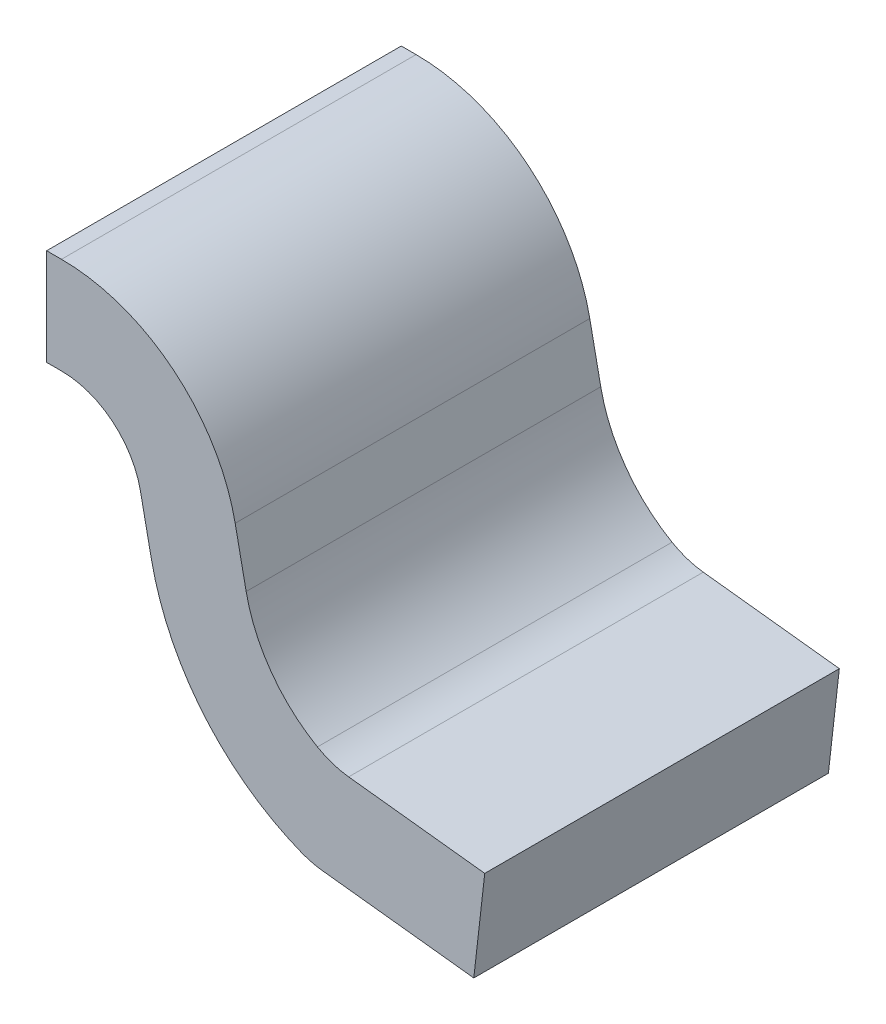
ISO-10303-21;
HEADER;
FILE_DESCRIPTION(('STEP AP214'),'2;1');
FILE_NAME('part.step','',(''),(''),'','','');
FILE_SCHEMA(('AUTOMOTIVE_DESIGN { 1 0 10303 214 1 1 1 1 }'));
ENDSEC;
DATA;
#1=APPLICATION_CONTEXT('core data for automotive mechanical design processes');
#2=APPLICATION_PROTOCOL_DEFINITION('international standard','automotive_design',2000,#1);
#3=PRODUCT_CONTEXT('',#1,'mechanical');
#4=PRODUCT('Part','Part','',(#3));
#5=PRODUCT_RELATED_PRODUCT_CATEGORY('part','',(#4));
#6=PRODUCT_DEFINITION_FORMATION('','',#4);
#7=PRODUCT_DEFINITION_CONTEXT('part definition',#1,'design');
#8=PRODUCT_DEFINITION('design','',#6,#7);
#9=PRODUCT_DEFINITION_SHAPE('','',#8);
#10=(LENGTH_UNIT() NAMED_UNIT(*) SI_UNIT(.MILLI.,.METRE.));
#11=(NAMED_UNIT(*) PLANE_ANGLE_UNIT() SI_UNIT($,.RADIAN.));
#12=(NAMED_UNIT(*) SI_UNIT($,.STERADIAN.) SOLID_ANGLE_UNIT());
#13=UNCERTAINTY_MEASURE_WITH_UNIT(LENGTH_MEASURE(1.E-05),#10,'distance_accuracy_value','');
#14=(GEOMETRIC_REPRESENTATION_CONTEXT(3) GLOBAL_UNCERTAINTY_ASSIGNED_CONTEXT((#13)) GLOBAL_UNIT_ASSIGNED_CONTEXT((#10,
#11,#12)) REPRESENTATION_CONTEXT('',''));
#15=CARTESIAN_POINT('',(0.,0.,0.));
#16=DIRECTION('',(0.,0.,1.));
#17=DIRECTION('',(1.,0.,0.));
#18=AXIS2_PLACEMENT_3D('',#15,#16,#17);
#19=CARTESIAN_POINT('',(1.0784798395513,0.311122151443952,3.64984430510635));
#20=DIRECTION('',(0.,0.,-1.));
#21=DIRECTION('',(-1.,0.,0.));
#22=AXIS2_PLACEMENT_3D('',#19,#20,#21);
#23=CYLINDRICAL_SURFACE('',#22,0.304673812487565);
#24=DIRECTION('',(0.,0.,1.));
#25=VECTOR('',#24,1.);
#26=CARTESIAN_POINT('',(0.966363747755728,0.0278270509282633,3.64984430510635));
#27=LINE('',#26,#25);
#28=CARTESIAN_POINT('',(0.966363747755728,0.0278270509282633,0.28));
#29=VERTEX_POINT('',#28);
#30=CARTESIAN_POINT('',(0.966363747755728,0.0278270509282633,0.72));
#31=VERTEX_POINT('',#30);
#32=EDGE_CURVE('E11',#29,#31,#27,.T.);
#33=ORIENTED_EDGE('',*,*,#32,.T.);
#34=CARTESIAN_POINT('',(1.0784798395513,0.311122151443952,0.72));
#35=DIRECTION('',(0.,0.,-1.));
#36=DIRECTION('',(-1.,0.,0.));
#37=AXIS2_PLACEMENT_3D('',#34,#35,#36);
#38=CIRCLE('',#37,0.304673812487565);
#39=CARTESIAN_POINT('',(0.78,0.25,0.72));
#40=VERTEX_POINT('',#39);
#41=EDGE_CURVE('E26',#31,#40,#38,.T.);
#42=ORIENTED_EDGE('',*,*,#41,.T.);
#43=DIRECTION('',(0.,0.,-1.));
#44=VECTOR('',#43,1.);
#45=CARTESIAN_POINT('',(0.78,0.25,3.64984430510635));
#46=LINE('',#45,#44);
#47=CARTESIAN_POINT('',(0.78,0.25,0.28));
#48=VERTEX_POINT('',#47);
#49=EDGE_CURVE('E252',#40,#48,#46,.T.);
#50=ORIENTED_EDGE('',*,*,#49,.T.);
#51=CARTESIAN_POINT('',(1.0784798395513,0.311122151443952,0.28));
#52=DIRECTION('',(0.,0.,1.));
#53=DIRECTION('',(-1.,0.,0.));
#54=AXIS2_PLACEMENT_3D('',#51,#52,#53);
#55=CIRCLE('',#54,0.304673812487565);
#56=EDGE_CURVE('E150',#48,#29,#55,.T.);
#57=ORIENTED_EDGE('',*,*,#56,.T.);
#58=EDGE_LOOP('',(#33,#42,#50,#57));
#59=FACE_BOUND('',#58,.T.);
#60=ADVANCED_FACE('F16',(#59),#23,.T.);
#61=CARTESIAN_POINT('',(-2.74150408033977,0.,0.72));
#62=DIRECTION('',(0.,0.,-1.));
#63=DIRECTION('',(0.707106781186548,0.707106781186548,0.));
#64=AXIS2_PLACEMENT_3D('',#61,#62,#63);
#65=PLANE('',#64);
#66=DIRECTION('',(-0.200615047761769,0.979670149903294,0.));
#67=VECTOR('',#66,1.);
#68=CARTESIAN_POINT('',(0.78,0.25,0.72));
#69=LINE('',#68,#67);
#70=CARTESIAN_POINT('',(0.766369657725015,0.316561504776177,0.72));
#71=VERTEX_POINT('',#70);
#72=EDGE_CURVE('E190',#40,#71,#69,.T.);
#73=ORIENTED_EDGE('',*,*,#72,.F.);
#74=ORIENTED_EDGE('',*,*,#41,.F.);
#75=CARTESIAN_POINT('',(1.003162477151,0.120810132802834,0.72));
#76=DIRECTION('',(0.,0.,-1.));
#77=DIRECTION('',(-1.,0.,0.));
#78=AXIS2_PLACEMENT_3D('',#75,#76,#77);
#79=CIRCLE('',#78,0.1);
#80=CARTESIAN_POINT('',(0.991834300901522,0.0214538424993983,0.72));
#81=VERTEX_POINT('',#80);
#82=EDGE_CURVE('E151',#81,#31,#79,.T.);
#83=ORIENTED_EDGE('',*,*,#82,.F.);
#84=DIRECTION('',(-0.993562903034357,0.113281762494854,0.));
#85=VECTOR('',#84,1.);
#86=CARTESIAN_POINT('',(1.17999999999987,0.,0.72));
#87=LINE('',#86,#85);
#88=CARTESIAN_POINT('',(1.17999999999987,0.,0.72));
#89=VERTEX_POINT('',#88);
#90=EDGE_CURVE('E184',#89,#81,#87,.T.);
#91=ORIENTED_EDGE('',*,*,#90,.F.);
#92=DIRECTION('',(-0.113281762495859,-0.993562903034243,0.));
#93=VECTOR('',#92,1.);
#94=CARTESIAN_POINT('',(1.19359381149938,0.119227548364123,0.72));
#95=LINE('',#94,#93);
#96=CARTESIAN_POINT('',(1.19359381149938,0.119227548364123,0.72));
#97=VERTEX_POINT('',#96);
#98=EDGE_CURVE('E185',#97,#89,#95,.T.);
#99=ORIENTED_EDGE('',*,*,#98,.F.);
#100=DIRECTION('',(0.993562903034362,-0.113281762494814,0.));
#101=VECTOR('',#100,1.);
#102=CARTESIAN_POINT('',(1.02473971532561,0.138479565081551,0.72));
#103=LINE('',#102,#101);
#104=CARTESIAN_POINT('',(1.02473971532561,0.138479565081551,0.72));
#105=VERTEX_POINT('',#104);
#106=EDGE_CURVE('E180',#105,#97,#103,.T.);
#107=ORIENTED_EDGE('',*,*,#106,.F.);
#108=CARTESIAN_POINT('',(1.03606789157509,0.237835855384987,0.72));
#109=DIRECTION('',(0.,0.,1.));
#110=DIRECTION('',(-1.,0.,0.));
#111=AXIS2_PLACEMENT_3D('',#108,#109,#110);
#112=CIRCLE('',#111,0.1);
#113=CARTESIAN_POINT('',(0.985979267087511,0.151284542876497,0.72));
#114=VERTEX_POINT('',#113);
#115=EDGE_CURVE('E175',#114,#105,#112,.T.);
#116=ORIENTED_EDGE('',*,*,#115,.F.);
#117=CARTESIAN_POINT('',(1.0784798395513,0.311122151443952,0.72));
#118=DIRECTION('',(0.,0.,1.));
#119=DIRECTION('',(-1.,0.,0.));
#120=AXIS2_PLACEMENT_3D('',#117,#118,#119);
#121=CIRCLE('',#120,0.184673812487565);
#122=CARTESIAN_POINT('',(0.897560417988396,0.274073805731411,0.72));
#123=VERTEX_POINT('',#122);
#124=EDGE_CURVE('E170',#123,#114,#121,.T.);
#125=ORIENTED_EDGE('',*,*,#124,.F.);
#126=DIRECTION('',(0.20061504776177,-0.979670149903294,0.));
#127=VECTOR('',#126,1.);
#128=CARTESIAN_POINT('',(0.883930075713411,0.340635310507587,0.72));
#129=LINE('',#128,#127);
#130=CARTESIAN_POINT('',(0.883930075713411,0.340635310507588,0.72));
#131=VERTEX_POINT('',#130);
#132=EDGE_CURVE('E165',#131,#123,#129,.T.);
#133=ORIENTED_EDGE('',*,*,#132,.F.);
#134=CARTESIAN_POINT('',(0.668402642734686,0.2965,0.72));
#135=DIRECTION('',(0.,0.,-1.));
#136=DIRECTION('',(-1.,0.,0.));
#137=AXIS2_PLACEMENT_3D('',#134,#135,#136);
#138=CIRCLE('',#137,0.22);
#139=CARTESIAN_POINT('',(0.668402642734686,0.5165,0.72));
#140=VERTEX_POINT('',#139);
#141=EDGE_CURVE('E208',#140,#131,#138,.T.);
#142=ORIENTED_EDGE('',*,*,#141,.F.);
#143=DIRECTION('',(1.,0.,0.));
#144=VECTOR('',#143,1.);
#145=CARTESIAN_POINT('',(-2.74150408033977,0.5165,0.72));
#146=LINE('',#145,#144);
#147=CARTESIAN_POINT('',(0.65,0.5165,0.72));
#148=VERTEX_POINT('',#147);
#149=EDGE_CURVE('E132',#148,#140,#146,.T.);
#150=ORIENTED_EDGE('',*,*,#149,.F.);
#151=DIRECTION('',(0.,1.,0.));
#152=VECTOR('',#151,1.);
#153=CARTESIAN_POINT('',(0.65,0.,0.72));
#154=LINE('',#153,#152);
#155=CARTESIAN_POINT('',(0.65,0.3965,0.72));
#156=VERTEX_POINT('',#155);
#157=EDGE_CURVE('E133',#156,#148,#154,.T.);
#158=ORIENTED_EDGE('',*,*,#157,.F.);
#159=DIRECTION('',(-1.,0.,0.));
#160=VECTOR('',#159,1.);
#161=CARTESIAN_POINT('',(-2.74150408033977,0.3965,0.72));
#162=LINE('',#161,#160);
#163=CARTESIAN_POINT('',(0.668402642734686,0.3965,0.72));
#164=VERTEX_POINT('',#163);
#165=EDGE_CURVE('E135',#164,#156,#162,.T.);
#166=ORIENTED_EDGE('',*,*,#165,.F.);
#167=CARTESIAN_POINT('',(0.668402642734686,0.2965,0.72));
#168=DIRECTION('',(0.,0.,1.));
#169=DIRECTION('',(-1.,0.,0.));
#170=AXIS2_PLACEMENT_3D('',#167,#168,#169);
#171=CIRCLE('',#170,0.1);
#172=EDGE_CURVE('E142',#71,#164,#171,.T.);
#173=ORIENTED_EDGE('',*,*,#172,.F.);
#174=EDGE_LOOP('',(#73,#74,#83,#91,#99,#107,#116,#125,#133,#142,#150,#158,#166,#173));
#175=FACE_BOUND('',#174,.T.);
#176=ADVANCED_FACE('F212',(#175),#65,.F.);
#177=CARTESIAN_POINT('',(1.003162477151,0.120810132802834,3.64984430510635));
#178=DIRECTION('',(0.,0.,-1.));
#179=DIRECTION('',(-1.,0.,0.));
#180=AXIS2_PLACEMENT_3D('',#177,#178,#179);
#181=CYLINDRICAL_SURFACE('',#180,0.1);
#182=DIRECTION('',(0.,0.,1.));
#183=VECTOR('',#182,1.);
#184=CARTESIAN_POINT('',(0.991834300901524,0.0214538424993981,3.64984430510635));
#185=LINE('',#184,#183);
#186=CARTESIAN_POINT('',(0.991834300901522,0.0214538424993983,0.28));
#187=VERTEX_POINT('',#186);
#188=EDGE_CURVE('E147',#187,#81,#185,.T.);
#189=ORIENTED_EDGE('',*,*,#188,.T.);
#190=ORIENTED_EDGE('',*,*,#82,.T.);
#191=ORIENTED_EDGE('',*,*,#32,.F.);
#192=CARTESIAN_POINT('',(1.003162477151,0.120810132802834,0.28));
#193=DIRECTION('',(0.,0.,1.));
#194=DIRECTION('',(-1.,0.,0.));
#195=AXIS2_PLACEMENT_3D('',#192,#193,#194);
#196=CIRCLE('',#195,0.1);
#197=EDGE_CURVE('E152',#29,#187,#196,.T.);
#198=ORIENTED_EDGE('',*,*,#197,.T.);
#199=EDGE_LOOP('',(#189,#190,#191,#198));
#200=FACE_BOUND('',#199,.T.);
#201=ADVANCED_FACE('F247',(#200),#181,.T.);
#202=CARTESIAN_POINT('',(-2.74150408033977,0.,0.28));
#203=DIRECTION('',(0.,0.,1.));
#204=DIRECTION('',(0.707106781186548,0.707106781186548,0.));
#205=AXIS2_PLACEMENT_3D('',#202,#203,#204);
#206=PLANE('',#205);
#207=DIRECTION('',(-1.,0.,0.));
#208=VECTOR('',#207,1.);
#209=CARTESIAN_POINT('',(-2.74150408033977,0.5165,0.28));
#210=LINE('',#209,#208);
#211=CARTESIAN_POINT('',(0.668402642734686,0.5165,0.28));
#212=VERTEX_POINT('',#211);
#213=CARTESIAN_POINT('',(0.65,0.5165,0.28));
#214=VERTEX_POINT('',#213);
#215=EDGE_CURVE('E155',#212,#214,#210,.T.);
#216=ORIENTED_EDGE('',*,*,#215,.F.);
#217=CARTESIAN_POINT('',(0.668402642734686,0.2965,0.28));
#218=DIRECTION('',(0.,0.,1.));
#219=DIRECTION('',(-1.,0.,0.));
#220=AXIS2_PLACEMENT_3D('',#217,#218,#219);
#221=CIRCLE('',#220,0.22);
#222=CARTESIAN_POINT('',(0.883930075713411,0.340635310507588,0.28));
#223=VERTEX_POINT('',#222);
#224=EDGE_CURVE('E157',#223,#212,#221,.T.);
#225=ORIENTED_EDGE('',*,*,#224,.F.);
#226=DIRECTION('',(-0.20061504776177,0.979670149903294,0.));
#227=VECTOR('',#226,1.);
#228=CARTESIAN_POINT('',(0.897560417988396,0.274073805731412,0.28));
#229=LINE('',#228,#227);
#230=CARTESIAN_POINT('',(0.897560417988396,0.274073805731411,0.28));
#231=VERTEX_POINT('',#230);
#232=EDGE_CURVE('E161',#231,#223,#229,.T.);
#233=ORIENTED_EDGE('',*,*,#232,.F.);
#234=CARTESIAN_POINT('',(1.0784798395513,0.311122151443952,0.28));
#235=DIRECTION('',(0.,0.,-1.));
#236=DIRECTION('',(-1.,0.,0.));
#237=AXIS2_PLACEMENT_3D('',#234,#235,#236);
#238=CIRCLE('',#237,0.184673812487565);
#239=CARTESIAN_POINT('',(0.985979267087511,0.151284542876497,0.28));
#240=VERTEX_POINT('',#239);
#241=EDGE_CURVE('E166',#240,#231,#238,.T.);
#242=ORIENTED_EDGE('',*,*,#241,.F.);
#243=CARTESIAN_POINT('',(1.03606789157509,0.237835855384987,0.28));
#244=DIRECTION('',(0.,0.,-1.));
#245=DIRECTION('',(-1.,0.,0.));
#246=AXIS2_PLACEMENT_3D('',#243,#244,#245);
#247=CIRCLE('',#246,0.1);
#248=CARTESIAN_POINT('',(1.02473971532561,0.138479565081551,0.28));
#249=VERTEX_POINT('',#248);
#250=EDGE_CURVE('E171',#249,#240,#247,.T.);
#251=ORIENTED_EDGE('',*,*,#250,.F.);
#252=DIRECTION('',(-0.993562903034363,0.113281762494801,0.));
#253=VECTOR('',#252,1.);
#254=CARTESIAN_POINT('',(1.19359381149938,0.119227548364125,0.28));
#255=LINE('',#254,#253);
#256=CARTESIAN_POINT('',(1.19359381149938,0.119227548364124,0.28));
#257=VERTEX_POINT('',#256);
#258=EDGE_CURVE('E176',#257,#249,#255,.T.);
#259=ORIENTED_EDGE('',*,*,#258,.F.);
#260=DIRECTION('',(0.113281762495857,0.993562903034243,0.));
#261=VECTOR('',#260,1.);
#262=CARTESIAN_POINT('',(1.17999999999987,0.,0.28));
#263=LINE('',#262,#261);
#264=CARTESIAN_POINT('',(1.17999999999987,0.,0.28));
#265=VERTEX_POINT('',#264);
#266=EDGE_CURVE('E181',#265,#257,#263,.T.);
#267=ORIENTED_EDGE('',*,*,#266,.F.);
#268=DIRECTION('',(0.993562903034357,-0.113281762494854,0.));
#269=VECTOR('',#268,1.);
#270=CARTESIAN_POINT('',(0.991834300901524,0.0214538424993981,0.28));
#271=LINE('',#270,#269);
#272=EDGE_CURVE('E146',#187,#265,#271,.T.);
#273=ORIENTED_EDGE('',*,*,#272,.F.);
#274=ORIENTED_EDGE('',*,*,#197,.F.);
#275=ORIENTED_EDGE('',*,*,#56,.F.);
#276=DIRECTION('',(0.200615047761769,-0.979670149903294,0.));
#277=VECTOR('',#276,1.);
#278=CARTESIAN_POINT('',(0.766369657725015,0.316561504776176,0.28));
#279=LINE('',#278,#277);
#280=CARTESIAN_POINT('',(0.766369657725015,0.316561504776177,0.28));
#281=VERTEX_POINT('',#280);
#282=EDGE_CURVE('E154',#281,#48,#279,.T.);
#283=ORIENTED_EDGE('',*,*,#282,.F.);
#284=CARTESIAN_POINT('',(0.668402642734686,0.2965,0.28));
#285=DIRECTION('',(0.,0.,-1.));
#286=DIRECTION('',(-1.,0.,0.));
#287=AXIS2_PLACEMENT_3D('',#284,#285,#286);
#288=CIRCLE('',#287,0.1);
#289=CARTESIAN_POINT('',(0.668402642734686,0.3965,0.28));
#290=VERTEX_POINT('',#289);
#291=EDGE_CURVE('E122',#290,#281,#288,.T.);
#292=ORIENTED_EDGE('',*,*,#291,.F.);
#293=DIRECTION('',(1.,0.,0.));
#294=VECTOR('',#293,1.);
#295=CARTESIAN_POINT('',(-2.74150408033977,0.3965,0.28));
#296=LINE('',#295,#294);
#297=CARTESIAN_POINT('',(0.65,0.3965,0.28));
#298=VERTEX_POINT('',#297);
#299=EDGE_CURVE('E114',#298,#290,#296,.T.);
#300=ORIENTED_EDGE('',*,*,#299,.F.);
#301=DIRECTION('',(0.,-1.,0.));
#302=VECTOR('',#301,1.);
#303=CARTESIAN_POINT('',(0.65,0.,0.28));
#304=LINE('',#303,#302);
#305=EDGE_CURVE('E119',#214,#298,#304,.T.);
#306=ORIENTED_EDGE('',*,*,#305,.F.);
#307=EDGE_LOOP('',(#216,#225,#233,#242,#251,#259,#267,#273,#274,#275,#283,#292,#300,#306));
#308=FACE_BOUND('',#307,.T.);
#309=ADVANCED_FACE('F118',(#308),#206,.F.);
#310=CARTESIAN_POINT('',(0.766369657725015,0.316561504776176,3.64984430510635));
#311=DIRECTION('',(0.979670149903295,0.200615047761767,0.));
#312=DIRECTION('',(-0.143305470647058,0.699808381659803,0.699808381659803));
#313=AXIS2_PLACEMENT_3D('',#310,#311,#312);
#314=PLANE('',#313);
#315=ORIENTED_EDGE('',*,*,#282,.T.);
#316=ORIENTED_EDGE('',*,*,#49,.F.);
#317=ORIENTED_EDGE('',*,*,#72,.T.);
#318=DIRECTION('',(0.,0.,1.));
#319=VECTOR('',#318,1.);
#320=CARTESIAN_POINT('',(0.766369657725015,0.316561504776176,3.64984430510635));
#321=LINE('',#320,#319);
#322=EDGE_CURVE('E145',#281,#71,#321,.T.);
#323=ORIENTED_EDGE('',*,*,#322,.F.);
#324=EDGE_LOOP('',(#315,#316,#317,#323));
#325=FACE_BOUND('',#324,.T.);
#326=ADVANCED_FACE('F268',(#325),#314,.F.);
#327=CARTESIAN_POINT('',(0.668402642734686,0.2965,3.64984430510635));
#328=DIRECTION('',(0.,0.,-1.));
#329=DIRECTION('',(-1.,0.,0.));
#330=AXIS2_PLACEMENT_3D('',#327,#328,#329);
#331=CYLINDRICAL_SURFACE('',#330,0.1);
#332=ORIENTED_EDGE('',*,*,#291,.T.);
#333=ORIENTED_EDGE('',*,*,#322,.T.);
#334=ORIENTED_EDGE('',*,*,#172,.T.);
#335=DIRECTION('',(0.,0.,1.));
#336=VECTOR('',#335,1.);
#337=CARTESIAN_POINT('',(0.668402642734685,0.3965,3.64984430510635));
#338=LINE('',#337,#336);
#339=EDGE_CURVE('E125',#290,#164,#338,.T.);
#340=ORIENTED_EDGE('',*,*,#339,.F.);
#341=EDGE_LOOP('',(#332,#333,#334,#340));
#342=FACE_BOUND('',#341,.T.);
#343=ADVANCED_FACE('F270',(#342),#331,.F.);
#344=CARTESIAN_POINT('',(1.18,0.,3.64984430510635));
#345=DIRECTION('',(0.113281762494813,0.993562903034362,0.));
#346=DIRECTION('',(0.704819900881673,-0.0803605291315247,0.704819900881673));
#347=AXIS2_PLACEMENT_3D('',#344,#345,#346);
#348=PLANE('',#347);
#349=ORIENTED_EDGE('',*,*,#272,.T.);
#350=DIRECTION('',(0.,0.,-1.));
#351=VECTOR('',#350,1.);
#352=CARTESIAN_POINT('',(1.17999999999987,0.,3.64984430510635));
#353=LINE('',#352,#351);
#354=EDGE_CURVE('E179',#89,#265,#353,.T.);
#355=ORIENTED_EDGE('',*,*,#354,.F.);
#356=ORIENTED_EDGE('',*,*,#90,.T.);
#357=ORIENTED_EDGE('',*,*,#188,.F.);
#358=EDGE_LOOP('',(#349,#355,#356,#357));
#359=FACE_BOUND('',#358,.T.);
#360=ADVANCED_FACE('F244',(#359),#348,.F.);
#361=CARTESIAN_POINT('',(1.19359381149938,0.119227548364123,3.64984430510635));
#362=DIRECTION('',(-0.993562903034362,0.113281762494813,0.));
#363=DIRECTION('',(0.080360529131525,0.704819900881673,0.704819900881673));
#364=AXIS2_PLACEMENT_3D('',#361,#362,#363);
#365=PLANE('',#364);
#366=ORIENTED_EDGE('',*,*,#266,.T.);
#367=DIRECTION('',(0.,0.,-1.));
#368=VECTOR('',#367,1.);
#369=CARTESIAN_POINT('',(1.19359381149938,0.119227548364123,3.64984430510635));
#370=LINE('',#369,#368);
#371=EDGE_CURVE('E174',#97,#257,#370,.T.);
#372=ORIENTED_EDGE('',*,*,#371,.F.);
#373=ORIENTED_EDGE('',*,*,#98,.T.);
#374=ORIENTED_EDGE('',*,*,#354,.T.);
#375=EDGE_LOOP('',(#366,#372,#373,#374));
#376=FACE_BOUND('',#375,.T.);
#377=ADVANCED_FACE('F237',(#376),#365,.F.);
#378=CARTESIAN_POINT('',(1.19359381149938,0.119227548364123,3.64984430510635));
#379=DIRECTION('',(-0.113281762494812,-0.993562903034362,0.));
#380=DIRECTION('',(0.704819900881673,-0.0803605291315244,0.704819900881673));
#381=AXIS2_PLACEMENT_3D('',#378,#379,#380);
#382=PLANE('',#381);
#383=ORIENTED_EDGE('',*,*,#258,.T.);
#384=DIRECTION('',(0.,0.,-1.));
#385=VECTOR('',#384,1.);
#386=CARTESIAN_POINT('',(1.02473971532561,0.138479565081551,3.64984430510635));
#387=LINE('',#386,#385);
#388=EDGE_CURVE('E169',#105,#249,#387,.T.);
#389=ORIENTED_EDGE('',*,*,#388,.F.);
#390=ORIENTED_EDGE('',*,*,#106,.T.);
#391=ORIENTED_EDGE('',*,*,#371,.T.);
#392=EDGE_LOOP('',(#383,#389,#390,#391));
#393=FACE_BOUND('',#392,.T.);
#394=ADVANCED_FACE('F233',(#393),#382,.F.);
#395=CARTESIAN_POINT('',(1.03606789157509,0.237835855384987,3.64984430510635));
#396=DIRECTION('',(0.,0.,-1.));
#397=DIRECTION('',(-1.,0.,0.));
#398=AXIS2_PLACEMENT_3D('',#395,#396,#397);
#399=CYLINDRICAL_SURFACE('',#398,0.1);
#400=ORIENTED_EDGE('',*,*,#250,.T.);
#401=DIRECTION('',(0.,0.,-1.));
#402=VECTOR('',#401,1.);
#403=CARTESIAN_POINT('',(0.985979267087511,0.151284542876497,3.64984430510635));
#404=LINE('',#403,#402);
#405=EDGE_CURVE('E164',#114,#240,#404,.T.);
#406=ORIENTED_EDGE('',*,*,#405,.F.);
#407=ORIENTED_EDGE('',*,*,#115,.T.);
#408=ORIENTED_EDGE('',*,*,#388,.T.);
#409=EDGE_LOOP('',(#400,#406,#407,#408));
#410=FACE_BOUND('',#409,.T.);
#411=ADVANCED_FACE('F229',(#410),#399,.F.);
#412=CARTESIAN_POINT('',(1.0784798395513,0.311122151443952,3.64984430510635));
#413=DIRECTION('',(0.,0.,-1.));
#414=DIRECTION('',(-1.,0.,0.));
#415=AXIS2_PLACEMENT_3D('',#412,#413,#414);
#416=CYLINDRICAL_SURFACE('',#415,0.184673812487565);
#417=ORIENTED_EDGE('',*,*,#241,.T.);
#418=DIRECTION('',(0.,0.,-1.));
#419=VECTOR('',#418,1.);
#420=CARTESIAN_POINT('',(0.897560417988396,0.274073805731412,3.64984430510635));
#421=LINE('',#420,#419);
#422=EDGE_CURVE('E202',#123,#231,#421,.T.);
#423=ORIENTED_EDGE('',*,*,#422,.F.);
#424=ORIENTED_EDGE('',*,*,#124,.T.);
#425=ORIENTED_EDGE('',*,*,#405,.T.);
#426=EDGE_LOOP('',(#417,#423,#424,#425));
#427=FACE_BOUND('',#426,.T.);
#428=ADVANCED_FACE('F225',(#427),#416,.F.);
#429=CARTESIAN_POINT('',(0.883930075713411,0.340635310507587,3.64984430510635));
#430=DIRECTION('',(-0.979670149903295,-0.200615047761767,0.));
#431=DIRECTION('',(-0.143305470647059,0.699808381659803,0.699808381659803));
#432=AXIS2_PLACEMENT_3D('',#429,#430,#431);
#433=PLANE('',#432);
#434=ORIENTED_EDGE('',*,*,#232,.T.);
#435=DIRECTION('',(0.,0.,-1.));
#436=VECTOR('',#435,1.);
#437=CARTESIAN_POINT('',(0.883930075713411,0.340635310507587,3.64984430510635));
#438=LINE('',#437,#436);
#439=EDGE_CURVE('E160',#131,#223,#438,.T.);
#440=ORIENTED_EDGE('',*,*,#439,.F.);
#441=ORIENTED_EDGE('',*,*,#132,.T.);
#442=ORIENTED_EDGE('',*,*,#422,.T.);
#443=EDGE_LOOP('',(#434,#440,#441,#442));
#444=FACE_BOUND('',#443,.T.);
#445=ADVANCED_FACE('F221',(#444),#433,.F.);
#446=CARTESIAN_POINT('',(0.668402642734686,0.2965,3.64984430510635));
#447=DIRECTION('',(0.,0.,-1.));
#448=DIRECTION('',(-1.,0.,0.));
#449=AXIS2_PLACEMENT_3D('',#446,#447,#448);
#450=CYLINDRICAL_SURFACE('',#449,0.22);
#451=DIRECTION('',(0.,0.,1.));
#452=VECTOR('',#451,1.);
#453=CARTESIAN_POINT('',(0.668402642734685,0.5165,3.64984430510635));
#454=LINE('',#453,#452);
#455=EDGE_CURVE('E205',#212,#140,#454,.T.);
#456=ORIENTED_EDGE('',*,*,#455,.T.);
#457=ORIENTED_EDGE('',*,*,#141,.T.);
#458=ORIENTED_EDGE('',*,*,#439,.T.);
#459=ORIENTED_EDGE('',*,*,#224,.T.);
#460=EDGE_LOOP('',(#456,#457,#458,#459));
#461=FACE_BOUND('',#460,.T.);
#462=ADVANCED_FACE('F218',(#461),#450,.T.);
#463=CARTESIAN_POINT('',(0.65,0.5165,3.64984430510635));
#464=DIRECTION('',(0.,-1.,0.));
#465=DIRECTION('',(0.707106781186548,0.,0.707106781186548));
#466=AXIS2_PLACEMENT_3D('',#463,#464,#465);
#467=PLANE('',#466);
#468=ORIENTED_EDGE('',*,*,#215,.T.);
#469=DIRECTION('',(0.,0.,-1.));
#470=VECTOR('',#469,1.);
#471=CARTESIAN_POINT('',(0.65,0.5165,3.64984430510635));
#472=LINE('',#471,#470);
#473=EDGE_CURVE('E124',#148,#214,#472,.T.);
#474=ORIENTED_EDGE('',*,*,#473,.F.);
#475=ORIENTED_EDGE('',*,*,#149,.T.);
#476=ORIENTED_EDGE('',*,*,#455,.F.);
#477=EDGE_LOOP('',(#468,#474,#475,#476));
#478=FACE_BOUND('',#477,.T.);
#479=ADVANCED_FACE('F216',(#478),#467,.F.);
#480=CARTESIAN_POINT('',(0.65,0.5165,3.64984430510635));
#481=DIRECTION('',(1.,0.,0.));
#482=DIRECTION('',(0.,0.707106781186548,0.707106781186548));
#483=AXIS2_PLACEMENT_3D('',#480,#481,#482);
#484=PLANE('',#483);
#485=ORIENTED_EDGE('',*,*,#305,.T.);
#486=DIRECTION('',(0.,0.,-1.));
#487=VECTOR('',#486,1.);
#488=CARTESIAN_POINT('',(0.65,0.3965,3.64984430510635));
#489=LINE('',#488,#487);
#490=EDGE_CURVE('E20',#156,#298,#489,.T.);
#491=ORIENTED_EDGE('',*,*,#490,.F.);
#492=ORIENTED_EDGE('',*,*,#157,.T.);
#493=ORIENTED_EDGE('',*,*,#473,.T.);
#494=EDGE_LOOP('',(#485,#491,#492,#493));
#495=FACE_BOUND('',#494,.T.);
#496=ADVANCED_FACE('F130',(#495),#484,.F.);
#497=CARTESIAN_POINT('',(0.65,0.3965,3.64984430510635));
#498=DIRECTION('',(0.,1.,0.));
#499=DIRECTION('',(0.707106781186548,0.,0.707106781186548));
#500=AXIS2_PLACEMENT_3D('',#497,#498,#499);
#501=PLANE('',#500);
#502=ORIENTED_EDGE('',*,*,#299,.T.);
#503=ORIENTED_EDGE('',*,*,#339,.T.);
#504=ORIENTED_EDGE('',*,*,#165,.T.);
#505=ORIENTED_EDGE('',*,*,#490,.T.);
#506=EDGE_LOOP('',(#502,#503,#504,#505));
#507=FACE_BOUND('',#506,.T.);
#508=ADVANCED_FACE('F18',(#507),#501,.F.);
#509=CLOSED_SHELL('',(#60,#176,#201,#309,#326,#343,#360,#377,#394,#411,#428,#445,#462,#479,#496,#508));
#510=MANIFOLD_SOLID_BREP('B1',#509);
#511=ADVANCED_BREP_SHAPE_REPRESENTATION('',(#18,#510),#14);
#512=SHAPE_DEFINITION_REPRESENTATION(#9,#511);
ENDSEC;
END-ISO-10303-21;
